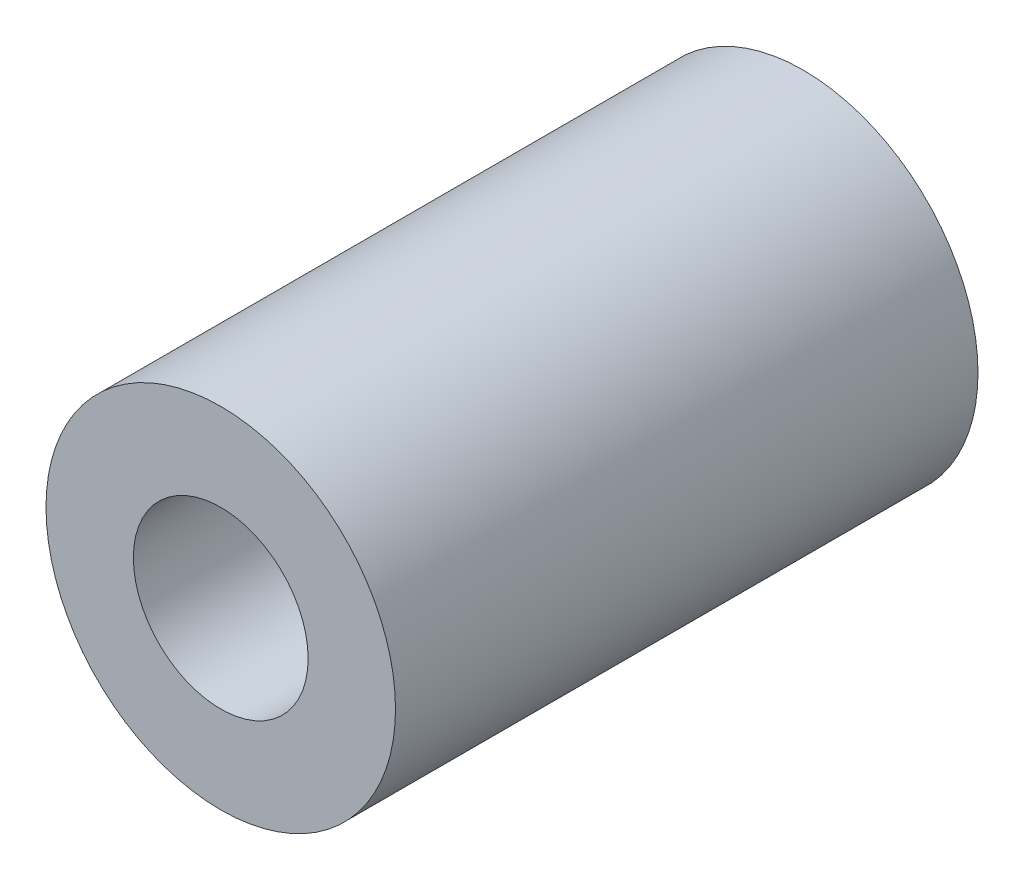
ISO-10303-21;
HEADER;
FILE_DESCRIPTION(('STEP AP214'),'2;1');
FILE_NAME('part.step','',(''),(''),'','','');
FILE_SCHEMA(('AUTOMOTIVE_DESIGN { 1 0 10303 214 1 1 1 1 }'));
ENDSEC;
DATA;
#1=APPLICATION_CONTEXT('core data for automotive mechanical design processes');
#2=APPLICATION_PROTOCOL_DEFINITION('international standard','automotive_design',2000,#1);
#3=PRODUCT_CONTEXT('',#1,'mechanical');
#4=PRODUCT('Part','Part','',(#3));
#5=PRODUCT_RELATED_PRODUCT_CATEGORY('part','',(#4));
#6=PRODUCT_DEFINITION_FORMATION('','',#4);
#7=PRODUCT_DEFINITION_CONTEXT('part definition',#1,'design');
#8=PRODUCT_DEFINITION('design','',#6,#7);
#9=PRODUCT_DEFINITION_SHAPE('','',#8);
#10=(LENGTH_UNIT() NAMED_UNIT(*) SI_UNIT(.MILLI.,.METRE.));
#11=(NAMED_UNIT(*) PLANE_ANGLE_UNIT() SI_UNIT($,.RADIAN.));
#12=(NAMED_UNIT(*) SI_UNIT($,.STERADIAN.) SOLID_ANGLE_UNIT());
#13=UNCERTAINTY_MEASURE_WITH_UNIT(LENGTH_MEASURE(1.E-05),#10,'distance_accuracy_value','');
#14=(GEOMETRIC_REPRESENTATION_CONTEXT(3) GLOBAL_UNCERTAINTY_ASSIGNED_CONTEXT((#13)) GLOBAL_UNIT_ASSIGNED_CONTEXT((#10,
#11,#12)) REPRESENTATION_CONTEXT('',''));
#15=CARTESIAN_POINT('',(0.,0.,0.));
#16=DIRECTION('',(0.,0.,1.));
#17=DIRECTION('',(1.,0.,0.));
#18=AXIS2_PLACEMENT_3D('',#15,#16,#17);
#19=CARTESIAN_POINT('',(0.,0.,5.));
#20=DIRECTION('',(0.,0.,1.));
#21=DIRECTION('',(1.,0.,0.));
#22=AXIS2_PLACEMENT_3D('',#19,#20,#21);
#23=PLANE('',#22);
#24=CARTESIAN_POINT('',(0.,0.,5.));
#25=DIRECTION('',(0.,0.,1.));
#26=DIRECTION('',(1.,0.,0.));
#27=AXIS2_PLACEMENT_3D('',#24,#25,#26);
#28=CIRCLE('',#27,3.);
#29=CARTESIAN_POINT('',(3.,0.,5.));
#30=VERTEX_POINT('',#29);
#31=EDGE_CURVE('E10',#30,#30,#28,.T.);
#32=ORIENTED_EDGE('',*,*,#31,.T.);
#33=EDGE_LOOP('',(#32));
#34=FACE_BOUND('',#33,.T.);
#35=CARTESIAN_POINT('',(0.,0.,5.));
#36=DIRECTION('',(0.,0.,1.));
#37=DIRECTION('',(1.,0.,0.));
#38=AXIS2_PLACEMENT_3D('',#35,#36,#37);
#39=CIRCLE('',#38,1.5);
#40=CARTESIAN_POINT('',(1.5,0.,5.));
#41=VERTEX_POINT('',#40);
#42=EDGE_CURVE('E42',#41,#41,#39,.T.);
#43=ORIENTED_EDGE('',*,*,#42,.F.);
#44=EDGE_LOOP('',(#43));
#45=FACE_BOUND('',#44,.T.);
#46=ADVANCED_FACE('F31',(#34,#45),#23,.T.);
#47=CARTESIAN_POINT('',(0.,0.,-5.));
#48=DIRECTION('',(0.,0.,1.));
#49=DIRECTION('',(1.,0.,0.));
#50=AXIS2_PLACEMENT_3D('',#47,#48,#49);
#51=PLANE('',#50);
#52=CARTESIAN_POINT('',(0.,0.,-5.));
#53=DIRECTION('',(0.,0.,1.));
#54=DIRECTION('',(1.,0.,0.));
#55=AXIS2_PLACEMENT_3D('',#52,#53,#54);
#56=CIRCLE('',#55,3.);
#57=CARTESIAN_POINT('',(3.,0.,-5.));
#58=VERTEX_POINT('',#57);
#59=EDGE_CURVE('E35',#58,#58,#56,.T.);
#60=ORIENTED_EDGE('',*,*,#59,.F.);
#61=EDGE_LOOP('',(#60));
#62=FACE_BOUND('',#61,.T.);
#63=CARTESIAN_POINT('',(0.,0.,-5.));
#64=DIRECTION('',(0.,0.,1.));
#65=DIRECTION('',(1.,0.,0.));
#66=AXIS2_PLACEMENT_3D('',#63,#64,#65);
#67=CIRCLE('',#66,1.5);
#68=CARTESIAN_POINT('',(1.5,0.,-5.));
#69=VERTEX_POINT('',#68);
#70=EDGE_CURVE('E44',#69,#69,#67,.T.);
#71=ORIENTED_EDGE('',*,*,#70,.T.);
#72=EDGE_LOOP('',(#71));
#73=FACE_BOUND('',#72,.T.);
#74=ADVANCED_FACE('F54',(#62,#73),#51,.F.);
#75=CARTESIAN_POINT('',(0.,0.,5.));
#76=DIRECTION('',(0.,0.,-1.));
#77=DIRECTION('',(-1.,0.,0.));
#78=AXIS2_PLACEMENT_3D('',#75,#76,#77);
#79=CYLINDRICAL_SURFACE('',#78,3.);
#80=ORIENTED_EDGE('',*,*,#31,.F.);
#81=EDGE_LOOP('',(#80));
#82=FACE_BOUND('',#81,.T.);
#83=ORIENTED_EDGE('',*,*,#59,.T.);
#84=EDGE_LOOP('',(#83));
#85=FACE_BOUND('',#84,.T.);
#86=ADVANCED_FACE('F33',(#82,#85),#79,.T.);
#87=CARTESIAN_POINT('',(0.,0.,5.));
#88=DIRECTION('',(0.,0.,-1.));
#89=DIRECTION('',(-1.,0.,0.));
#90=AXIS2_PLACEMENT_3D('',#87,#88,#89);
#91=CYLINDRICAL_SURFACE('',#90,1.5);
#92=ORIENTED_EDGE('',*,*,#42,.T.);
#93=EDGE_LOOP('',(#92));
#94=FACE_BOUND('',#93,.T.);
#95=ORIENTED_EDGE('',*,*,#70,.F.);
#96=EDGE_LOOP('',(#95));
#97=FACE_BOUND('',#96,.T.);
#98=ADVANCED_FACE('F50',(#94,#97),#91,.F.);
#99=CLOSED_SHELL('',(#46,#74,#86,#98));
#100=MANIFOLD_SOLID_BREP('B2',#99);
#101=ADVANCED_BREP_SHAPE_REPRESENTATION('',(#18,#100),#14);
#102=SHAPE_DEFINITION_REPRESENTATION(#9,#101);
ENDSEC;
END-ISO-10303-21;
